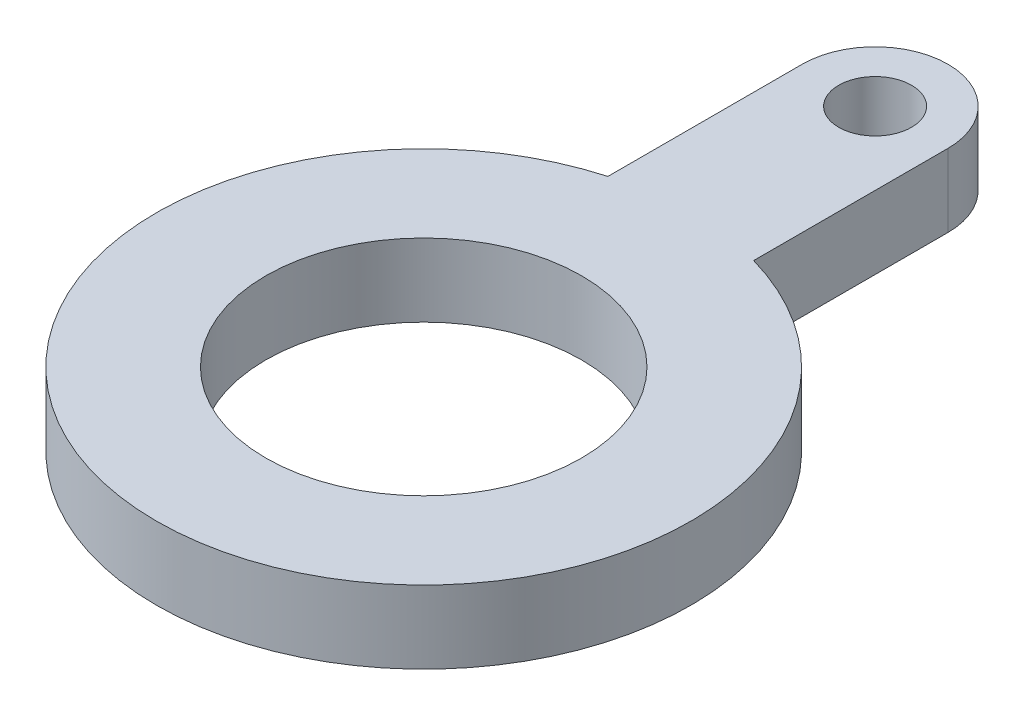
ISO-10303-21;
HEADER;
FILE_DESCRIPTION(('STEP AP214'),'2;1');
FILE_NAME('part.step','',(''),(''),'','','');
FILE_SCHEMA(('AUTOMOTIVE_DESIGN { 1 0 10303 214 1 1 1 1 }'));
ENDSEC;
DATA;
#1=APPLICATION_CONTEXT('core data for automotive mechanical design processes');
#2=APPLICATION_PROTOCOL_DEFINITION('international standard','automotive_design',2000,#1);
#3=PRODUCT_CONTEXT('',#1,'mechanical');
#4=PRODUCT('Part','Part','',(#3));
#5=PRODUCT_RELATED_PRODUCT_CATEGORY('part','',(#4));
#6=PRODUCT_DEFINITION_FORMATION('','',#4);
#7=PRODUCT_DEFINITION_CONTEXT('part definition',#1,'design');
#8=PRODUCT_DEFINITION('design','',#6,#7);
#9=PRODUCT_DEFINITION_SHAPE('','',#8);
#10=(LENGTH_UNIT() NAMED_UNIT(*) SI_UNIT(.MILLI.,.METRE.));
#11=(NAMED_UNIT(*) PLANE_ANGLE_UNIT() SI_UNIT($,.RADIAN.));
#12=(NAMED_UNIT(*) SI_UNIT($,.STERADIAN.) SOLID_ANGLE_UNIT());
#13=UNCERTAINTY_MEASURE_WITH_UNIT(LENGTH_MEASURE(1.E-05),#10,'distance_accuracy_value','');
#14=(GEOMETRIC_REPRESENTATION_CONTEXT(3) GLOBAL_UNCERTAINTY_ASSIGNED_CONTEXT((#13)) GLOBAL_UNIT_ASSIGNED_CONTEXT((#10,
#11,#12)) REPRESENTATION_CONTEXT('',''));
#15=CARTESIAN_POINT('',(0.,0.,0.));
#16=DIRECTION('',(0.,0.,1.));
#17=DIRECTION('',(1.,0.,0.));
#18=AXIS2_PLACEMENT_3D('',#15,#16,#17);
#19=CARTESIAN_POINT('',(0.,3.,0.));
#20=DIRECTION('',(0.,1.,0.));
#21=DIRECTION('',(0.,0.,1.));
#22=AXIS2_PLACEMENT_3D('',#19,#20,#21);
#23=PLANE('',#22);
#24=CARTESIAN_POINT('',(0.,3.,0.));
#25=DIRECTION('',(0.,1.,0.));
#26=DIRECTION('',(0.,0.,1.));
#27=AXIS2_PLACEMENT_3D('',#24,#25,#26);
#28=CIRCLE('',#27,6.5);
#29=CARTESIAN_POINT('',(0.,3.,6.5));
#30=VERTEX_POINT('',#29);
#31=EDGE_CURVE('E130',#30,#30,#28,.T.);
#32=ORIENTED_EDGE('',*,*,#31,.F.);
#33=EDGE_LOOP('',(#32));
#34=FACE_BOUND('',#33,.T.);
#35=CARTESIAN_POINT('',(0.,3.,0.));
#36=DIRECTION('',(0.,1.,0.));
#37=DIRECTION('',(0.,0.,1.));
#38=AXIS2_PLACEMENT_3D('',#35,#36,#37);
#39=CIRCLE('',#38,11.);
#40=CARTESIAN_POINT('',(-3.,3.,-10.5830052442584));
#41=VERTEX_POINT('',#40);
#42=CARTESIAN_POINT('',(3.,3.,-10.5830052442584));
#43=VERTEX_POINT('',#42);
#44=EDGE_CURVE('E114',#41,#43,#39,.T.);
#45=ORIENTED_EDGE('',*,*,#44,.T.);
#46=DIRECTION('',(0.,0.,-1.));
#47=VECTOR('',#46,1.);
#48=CARTESIAN_POINT('',(3.,3.,-10.5830052442584));
#49=LINE('',#48,#47);
#50=CARTESIAN_POINT('',(3.,3.,-18.5830052442584));
#51=VERTEX_POINT('',#50);
#52=EDGE_CURVE('E107',#43,#51,#49,.T.);
#53=ORIENTED_EDGE('',*,*,#52,.T.);
#54=CARTESIAN_POINT('',(0.,3.,-18.5830052442584));
#55=DIRECTION('',(0.,1.,0.));
#56=DIRECTION('',(0.,0.,1.));
#57=AXIS2_PLACEMENT_3D('',#54,#55,#56);
#58=CIRCLE('',#57,3.);
#59=CARTESIAN_POINT('',(-3.,3.,-18.5830052442584));
#60=VERTEX_POINT('',#59);
#61=EDGE_CURVE('E113',#51,#60,#58,.T.);
#62=ORIENTED_EDGE('',*,*,#61,.T.);
#63=DIRECTION('',(0.,0.,-1.));
#64=VECTOR('',#63,1.);
#65=CARTESIAN_POINT('',(-3.,3.,-10.5830052442584));
#66=LINE('',#65,#64);
#67=EDGE_CURVE('E123',#41,#60,#66,.T.);
#68=ORIENTED_EDGE('',*,*,#67,.F.);
#69=EDGE_LOOP('',(#45,#53,#62,#68));
#70=FACE_BOUND('',#69,.T.);
#71=CARTESIAN_POINT('',(0.,3.,-18.5830052442584));
#72=DIRECTION('',(0.,1.,0.));
#73=DIRECTION('',(0.,0.,1.));
#74=AXIS2_PLACEMENT_3D('',#71,#72,#73);
#75=CIRCLE('',#74,1.5);
#76=CARTESIAN_POINT('',(0.,3.,-17.0830052442584));
#77=VERTEX_POINT('',#76);
#78=EDGE_CURVE('E143',#77,#77,#75,.T.);
#79=ORIENTED_EDGE('',*,*,#78,.F.);
#80=EDGE_LOOP('',(#79));
#81=FACE_BOUND('',#80,.T.);
#82=ADVANCED_FACE('F64',(#34,#70,#81),#23,.T.);
#83=CARTESIAN_POINT('',(0.,0.,0.));
#84=DIRECTION('',(0.,1.,0.));
#85=DIRECTION('',(0.,0.,1.));
#86=AXIS2_PLACEMENT_3D('',#83,#84,#85);
#87=PLANE('',#86);
#88=CARTESIAN_POINT('',(0.,0.,0.));
#89=DIRECTION('',(0.,1.,0.));
#90=DIRECTION('',(0.,0.,1.));
#91=AXIS2_PLACEMENT_3D('',#88,#89,#90);
#92=CIRCLE('',#91,11.);
#93=CARTESIAN_POINT('',(-3.,0.,-10.5830052442584));
#94=VERTEX_POINT('',#93);
#95=CARTESIAN_POINT('',(3.,0.,-10.5830052442584));
#96=VERTEX_POINT('',#95);
#97=EDGE_CURVE('E128',#94,#96,#92,.T.);
#98=ORIENTED_EDGE('',*,*,#97,.F.);
#99=DIRECTION('',(0.,0.,-1.));
#100=VECTOR('',#99,1.);
#101=CARTESIAN_POINT('',(-3.,0.,-10.5830052442584));
#102=LINE('',#101,#100);
#103=CARTESIAN_POINT('',(-3.,0.,-18.5830052442584));
#104=VERTEX_POINT('',#103);
#105=EDGE_CURVE('E134',#94,#104,#102,.T.);
#106=ORIENTED_EDGE('',*,*,#105,.T.);
#107=CARTESIAN_POINT('',(0.,0.,-18.5830052442584));
#108=DIRECTION('',(0.,1.,0.));
#109=DIRECTION('',(0.,0.,1.));
#110=AXIS2_PLACEMENT_3D('',#107,#108,#109);
#111=CIRCLE('',#110,3.);
#112=CARTESIAN_POINT('',(3.,0.,-18.5830052442584));
#113=VERTEX_POINT('',#112);
#114=EDGE_CURVE('E132',#113,#104,#111,.T.);
#115=ORIENTED_EDGE('',*,*,#114,.F.);
#116=DIRECTION('',(0.,0.,-1.));
#117=VECTOR('',#116,1.);
#118=CARTESIAN_POINT('',(3.,0.,-10.5830052442584));
#119=LINE('',#118,#117);
#120=EDGE_CURVE('E119',#96,#113,#119,.T.);
#121=ORIENTED_EDGE('',*,*,#120,.F.);
#122=EDGE_LOOP('',(#98,#106,#115,#121));
#123=FACE_BOUND('',#122,.T.);
#124=CARTESIAN_POINT('',(0.,0.,0.));
#125=DIRECTION('',(0.,1.,0.));
#126=DIRECTION('',(0.,0.,1.));
#127=AXIS2_PLACEMENT_3D('',#124,#125,#126);
#128=CIRCLE('',#127,6.5);
#129=CARTESIAN_POINT('',(0.,0.,6.5));
#130=VERTEX_POINT('',#129);
#131=EDGE_CURVE('E140',#130,#130,#128,.T.);
#132=ORIENTED_EDGE('',*,*,#131,.T.);
#133=EDGE_LOOP('',(#132));
#134=FACE_BOUND('',#133,.T.);
#135=CARTESIAN_POINT('',(0.,0.,-18.5830052442584));
#136=DIRECTION('',(0.,1.,0.));
#137=DIRECTION('',(0.,0.,1.));
#138=AXIS2_PLACEMENT_3D('',#135,#136,#137);
#139=CIRCLE('',#138,1.5);
#140=CARTESIAN_POINT('',(0.,0.,-17.0830052442584));
#141=VERTEX_POINT('',#140);
#142=EDGE_CURVE('E146',#141,#141,#139,.T.);
#143=ORIENTED_EDGE('',*,*,#142,.T.);
#144=EDGE_LOOP('',(#143));
#145=FACE_BOUND('',#144,.T.);
#146=ADVANCED_FACE('F155',(#123,#134,#145),#87,.F.);
#147=CARTESIAN_POINT('',(0.,3.,0.));
#148=DIRECTION('',(0.,-1.,0.));
#149=DIRECTION('',(0.,0.,-1.));
#150=AXIS2_PLACEMENT_3D('',#147,#148,#149);
#151=CYLINDRICAL_SURFACE('',#150,11.);
#152=ORIENTED_EDGE('',*,*,#97,.T.);
#153=DIRECTION('',(0.,-1.,0.));
#154=VECTOR('',#153,1.);
#155=CARTESIAN_POINT('',(3.,3.,-10.5830052442584));
#156=LINE('',#155,#154);
#157=EDGE_CURVE('E12',#43,#96,#156,.T.);
#158=ORIENTED_EDGE('',*,*,#157,.F.);
#159=ORIENTED_EDGE('',*,*,#44,.F.);
#160=DIRECTION('',(0.,-1.,0.));
#161=VECTOR('',#160,1.);
#162=CARTESIAN_POINT('',(-3.,3.,-10.5830052442584));
#163=LINE('',#162,#161);
#164=EDGE_CURVE('E81',#41,#94,#163,.T.);
#165=ORIENTED_EDGE('',*,*,#164,.T.);
#166=EDGE_LOOP('',(#152,#158,#159,#165));
#167=FACE_BOUND('',#166,.T.);
#168=ADVANCED_FACE('F66',(#167),#151,.T.);
#169=CARTESIAN_POINT('',(3.,3.,-10.5830052442584));
#170=DIRECTION('',(-1.,0.,0.));
#171=DIRECTION('',(0.,0.,1.));
#172=AXIS2_PLACEMENT_3D('',#169,#170,#171);
#173=PLANE('',#172);
#174=ORIENTED_EDGE('',*,*,#120,.T.);
#175=DIRECTION('',(0.,-1.,0.));
#176=VECTOR('',#175,1.);
#177=CARTESIAN_POINT('',(3.,3.,-18.5830052442584));
#178=LINE('',#177,#176);
#179=EDGE_CURVE('E73',#51,#113,#178,.T.);
#180=ORIENTED_EDGE('',*,*,#179,.F.);
#181=ORIENTED_EDGE('',*,*,#52,.F.);
#182=ORIENTED_EDGE('',*,*,#157,.T.);
#183=EDGE_LOOP('',(#174,#180,#181,#182));
#184=FACE_BOUND('',#183,.T.);
#185=ADVANCED_FACE('F118',(#184),#173,.F.);
#186=CARTESIAN_POINT('',(0.,3.,-18.5830052442584));
#187=DIRECTION('',(0.,-1.,0.));
#188=DIRECTION('',(0.,0.,-1.));
#189=AXIS2_PLACEMENT_3D('',#186,#187,#188);
#190=CYLINDRICAL_SURFACE('',#189,3.);
#191=ORIENTED_EDGE('',*,*,#114,.T.);
#192=DIRECTION('',(0.,-1.,0.));
#193=VECTOR('',#192,1.);
#194=CARTESIAN_POINT('',(-3.,3.,-18.5830052442584));
#195=LINE('',#194,#193);
#196=EDGE_CURVE('E96',#60,#104,#195,.T.);
#197=ORIENTED_EDGE('',*,*,#196,.F.);
#198=ORIENTED_EDGE('',*,*,#61,.F.);
#199=ORIENTED_EDGE('',*,*,#179,.T.);
#200=EDGE_LOOP('',(#191,#197,#198,#199));
#201=FACE_BOUND('',#200,.T.);
#202=ADVANCED_FACE('F122',(#201),#190,.T.);
#203=CARTESIAN_POINT('',(-3.,3.,-10.5830052442584));
#204=DIRECTION('',(-1.,0.,0.));
#205=DIRECTION('',(0.,0.,1.));
#206=AXIS2_PLACEMENT_3D('',#203,#204,#205);
#207=PLANE('',#206);
#208=ORIENTED_EDGE('',*,*,#105,.F.);
#209=ORIENTED_EDGE('',*,*,#164,.F.);
#210=ORIENTED_EDGE('',*,*,#67,.T.);
#211=ORIENTED_EDGE('',*,*,#196,.T.);
#212=EDGE_LOOP('',(#208,#209,#210,#211));
#213=FACE_BOUND('',#212,.T.);
#214=ADVANCED_FACE('F167',(#213),#207,.T.);
#215=CARTESIAN_POINT('',(0.,3.,0.));
#216=DIRECTION('',(0.,-1.,0.));
#217=DIRECTION('',(0.,0.,-1.));
#218=AXIS2_PLACEMENT_3D('',#215,#216,#217);
#219=CYLINDRICAL_SURFACE('',#218,6.5);
#220=ORIENTED_EDGE('',*,*,#31,.T.);
#221=EDGE_LOOP('',(#220));
#222=FACE_BOUND('',#221,.T.);
#223=ORIENTED_EDGE('',*,*,#131,.F.);
#224=EDGE_LOOP('',(#223));
#225=FACE_BOUND('',#224,.T.);
#226=ADVANCED_FACE('F164',(#222,#225),#219,.F.);
#227=CARTESIAN_POINT('',(0.,3.,-18.5830052442584));
#228=DIRECTION('',(0.,-1.,0.));
#229=DIRECTION('',(0.,0.,-1.));
#230=AXIS2_PLACEMENT_3D('',#227,#228,#229);
#231=CYLINDRICAL_SURFACE('',#230,1.5);
#232=ORIENTED_EDGE('',*,*,#78,.T.);
#233=EDGE_LOOP('',(#232));
#234=FACE_BOUND('',#233,.T.);
#235=ORIENTED_EDGE('',*,*,#142,.F.);
#236=EDGE_LOOP('',(#235));
#237=FACE_BOUND('',#236,.T.);
#238=ADVANCED_FACE('F152',(#234,#237),#231,.F.);
#239=CLOSED_SHELL('',(#82,#146,#168,#185,#202,#214,#226,#238));
#240=MANIFOLD_SOLID_BREP('B2',#239);
#241=ADVANCED_BREP_SHAPE_REPRESENTATION('',(#18,#240),#14);
#242=SHAPE_DEFINITION_REPRESENTATION(#9,#241);
ENDSEC;
END-ISO-10303-21;
